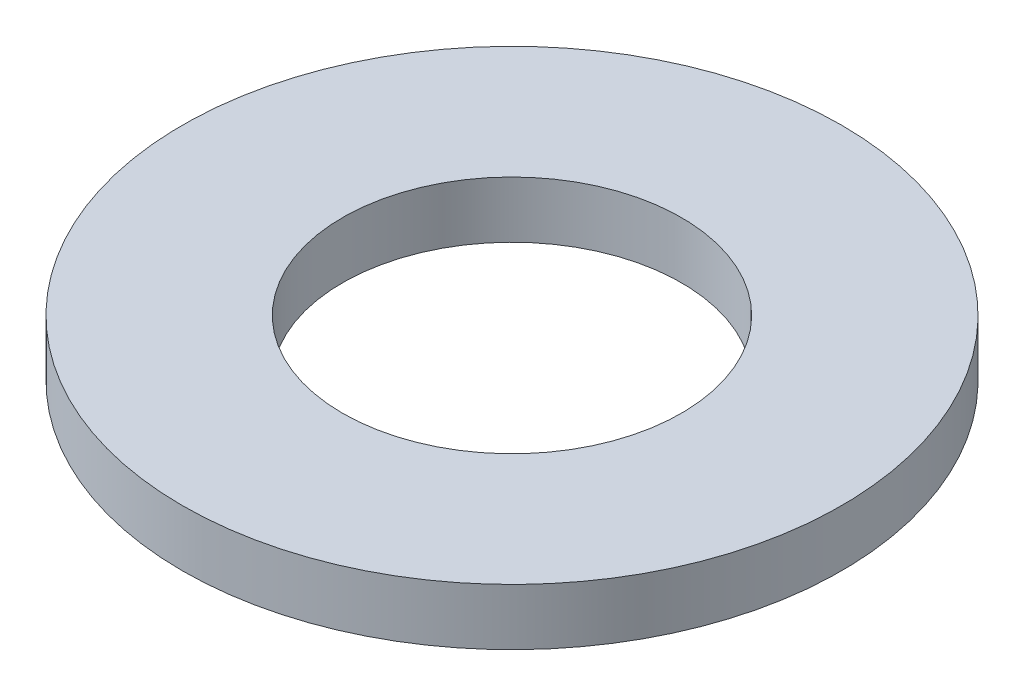
ISO-10303-21;
HEADER;
FILE_DESCRIPTION(('STEP AP214'),'2;1');
FILE_NAME('part.step','',(''),(''),'','','');
FILE_SCHEMA(('AUTOMOTIVE_DESIGN { 1 0 10303 214 1 1 1 1 }'));
ENDSEC;
DATA;
#1=APPLICATION_CONTEXT('core data for automotive mechanical design processes');
#2=APPLICATION_PROTOCOL_DEFINITION('international standard','automotive_design',2000,#1);
#3=PRODUCT_CONTEXT('',#1,'mechanical');
#4=PRODUCT('Part','Part','',(#3));
#5=PRODUCT_RELATED_PRODUCT_CATEGORY('part','',(#4));
#6=PRODUCT_DEFINITION_FORMATION('','',#4);
#7=PRODUCT_DEFINITION_CONTEXT('part definition',#1,'design');
#8=PRODUCT_DEFINITION('design','',#6,#7);
#9=PRODUCT_DEFINITION_SHAPE('','',#8);
#10=(LENGTH_UNIT() NAMED_UNIT(*) SI_UNIT(.MILLI.,.METRE.));
#11=(NAMED_UNIT(*) PLANE_ANGLE_UNIT() SI_UNIT($,.RADIAN.));
#12=(NAMED_UNIT(*) SI_UNIT($,.STERADIAN.) SOLID_ANGLE_UNIT());
#13=UNCERTAINTY_MEASURE_WITH_UNIT(LENGTH_MEASURE(1.E-05),#10,'distance_accuracy_value','');
#14=(GEOMETRIC_REPRESENTATION_CONTEXT(3) GLOBAL_UNCERTAINTY_ASSIGNED_CONTEXT((#13)) GLOBAL_UNIT_ASSIGNED_CONTEXT((#10,
#11,#12)) REPRESENTATION_CONTEXT('',''));
#15=CARTESIAN_POINT('',(0.,0.,0.));
#16=DIRECTION('',(0.,0.,1.));
#17=DIRECTION('',(1.,0.,0.));
#18=AXIS2_PLACEMENT_3D('',#15,#16,#17);
#19=CARTESIAN_POINT('',(0.,15.,0.));
#20=DIRECTION('',(0.,-1.,0.));
#21=DIRECTION('',(0.,0.,-1.));
#22=AXIS2_PLACEMENT_3D('',#19,#20,#21);
#23=CYLINDRICAL_SURFACE('',#22,87.5);
#24=CARTESIAN_POINT('',(0.,15.,0.));
#25=DIRECTION('',(0.,1.,0.));
#26=DIRECTION('',(0.,0.,1.));
#27=AXIS2_PLACEMENT_3D('',#24,#25,#26);
#28=CIRCLE('',#27,87.5);
#29=CARTESIAN_POINT('',(0.,15.,87.5));
#30=VERTEX_POINT('',#29);
#31=EDGE_CURVE('E10',#30,#30,#28,.T.);
#32=ORIENTED_EDGE('',*,*,#31,.F.);
#33=EDGE_LOOP('',(#32));
#34=FACE_BOUND('',#33,.T.);
#35=CARTESIAN_POINT('',(0.,0.,0.));
#36=DIRECTION('',(0.,1.,0.));
#37=DIRECTION('',(0.,0.,1.));
#38=AXIS2_PLACEMENT_3D('',#35,#36,#37);
#39=CIRCLE('',#38,87.5);
#40=CARTESIAN_POINT('',(0.,0.,87.5));
#41=VERTEX_POINT('',#40);
#42=EDGE_CURVE('E37',#41,#41,#39,.T.);
#43=ORIENTED_EDGE('',*,*,#42,.T.);
#44=EDGE_LOOP('',(#43));
#45=FACE_BOUND('',#44,.T.);
#46=ADVANCED_FACE('F40',(#34,#45),#23,.T.);
#47=CARTESIAN_POINT('',(0.,15.,0.));
#48=DIRECTION('',(0.,1.,0.));
#49=DIRECTION('',(0.,0.,1.));
#50=AXIS2_PLACEMENT_3D('',#47,#48,#49);
#51=PLANE('',#50);
#52=CARTESIAN_POINT('',(0.,15.,0.));
#53=DIRECTION('',(0.,1.,0.));
#54=DIRECTION('',(0.,0.,1.));
#55=AXIS2_PLACEMENT_3D('',#52,#53,#54);
#56=CIRCLE('',#55,45.);
#57=CARTESIAN_POINT('',(0.,15.,45.));
#58=VERTEX_POINT('',#57);
#59=EDGE_CURVE('E50',#58,#58,#56,.T.);
#60=ORIENTED_EDGE('',*,*,#59,.F.);
#61=EDGE_LOOP('',(#60));
#62=FACE_BOUND('',#61,.T.);
#63=ORIENTED_EDGE('',*,*,#31,.T.);
#64=EDGE_LOOP('',(#63));
#65=FACE_BOUND('',#64,.T.);
#66=ADVANCED_FACE('F59',(#62,#65),#51,.T.);
#67=CARTESIAN_POINT('',(0.,0.,0.));
#68=DIRECTION('',(0.,1.,0.));
#69=DIRECTION('',(0.,0.,1.));
#70=AXIS2_PLACEMENT_3D('',#67,#68,#69);
#71=PLANE('',#70);
#72=CARTESIAN_POINT('',(0.,0.,0.));
#73=DIRECTION('',(0.,1.,0.));
#74=DIRECTION('',(0.,0.,1.));
#75=AXIS2_PLACEMENT_3D('',#72,#73,#74);
#76=CIRCLE('',#75,45.);
#77=CARTESIAN_POINT('',(0.,0.,45.));
#78=VERTEX_POINT('',#77);
#79=EDGE_CURVE('E47',#78,#78,#76,.T.);
#80=ORIENTED_EDGE('',*,*,#79,.T.);
#81=EDGE_LOOP('',(#80));
#82=FACE_BOUND('',#81,.T.);
#83=ORIENTED_EDGE('',*,*,#42,.F.);
#84=EDGE_LOOP('',(#83));
#85=FACE_BOUND('',#84,.T.);
#86=ADVANCED_FACE('F58',(#82,#85),#71,.F.);
#87=CARTESIAN_POINT('',(0.,15.,0.));
#88=DIRECTION('',(0.,-1.,0.));
#89=DIRECTION('',(0.,0.,-1.));
#90=AXIS2_PLACEMENT_3D('',#87,#88,#89);
#91=CYLINDRICAL_SURFACE('',#90,45.);
#92=ORIENTED_EDGE('',*,*,#59,.T.);
#93=EDGE_LOOP('',(#92));
#94=FACE_BOUND('',#93,.T.);
#95=ORIENTED_EDGE('',*,*,#79,.F.);
#96=EDGE_LOOP('',(#95));
#97=FACE_BOUND('',#96,.T.);
#98=ADVANCED_FACE('F54',(#94,#97),#91,.F.);
#99=CLOSED_SHELL('',(#46,#66,#86,#98));
#100=MANIFOLD_SOLID_BREP('B2',#99);
#101=ADVANCED_BREP_SHAPE_REPRESENTATION('',(#18,#100),#14);
#102=SHAPE_DEFINITION_REPRESENTATION(#9,#101);
ENDSEC;
END-ISO-10303-21;
